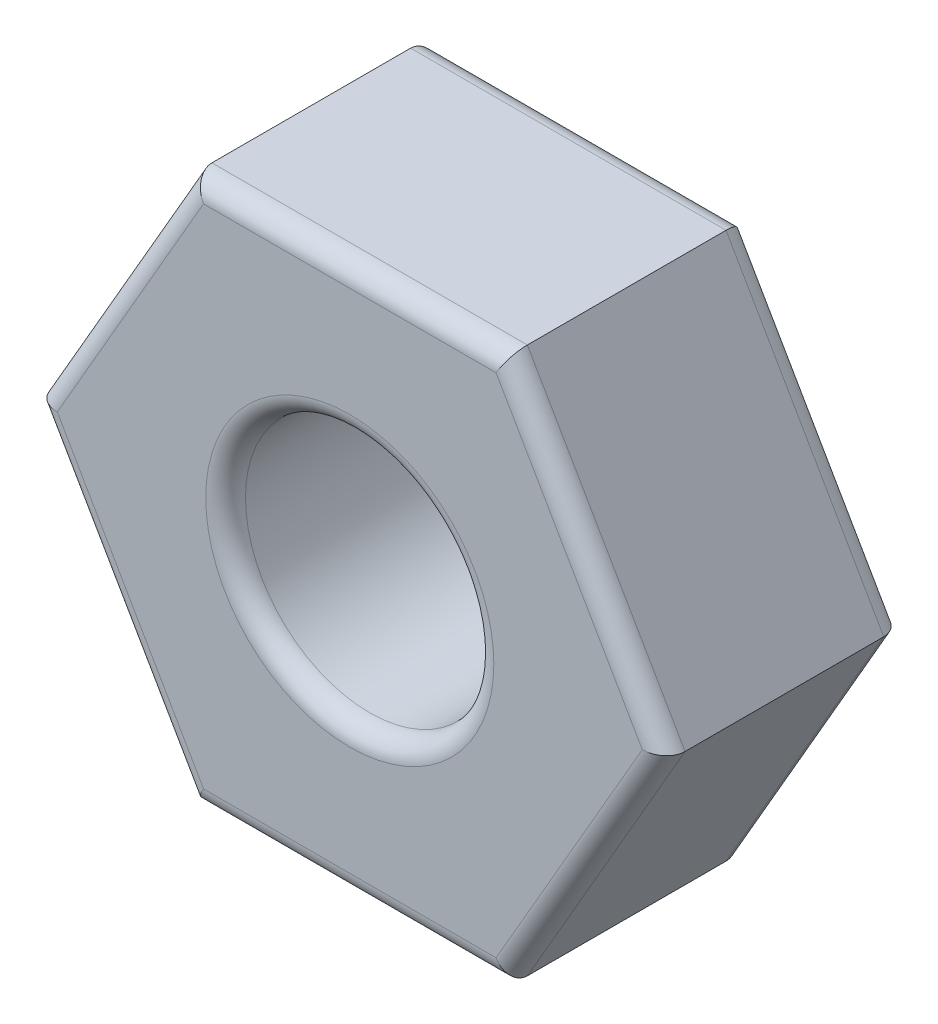
ISO-10303-21;
HEADER;
FILE_DESCRIPTION(('STEP AP214'),'2;1');
FILE_NAME('part.step','',(''),(''),'','','');
FILE_SCHEMA(('AUTOMOTIVE_DESIGN { 1 0 10303 214 1 1 1 1 }'));
ENDSEC;
DATA;
#1=APPLICATION_CONTEXT('core data for automotive mechanical design processes');
#2=APPLICATION_PROTOCOL_DEFINITION('international standard','automotive_design',2000,#1);
#3=PRODUCT_CONTEXT('',#1,'mechanical');
#4=PRODUCT('Part','Part','',(#3));
#5=PRODUCT_RELATED_PRODUCT_CATEGORY('part','',(#4));
#6=PRODUCT_DEFINITION_FORMATION('','',#4);
#7=PRODUCT_DEFINITION_CONTEXT('part definition',#1,'design');
#8=PRODUCT_DEFINITION('design','',#6,#7);
#9=PRODUCT_DEFINITION_SHAPE('','',#8);
#10=(LENGTH_UNIT() NAMED_UNIT(*) SI_UNIT(.MILLI.,.METRE.));
#11=(NAMED_UNIT(*) PLANE_ANGLE_UNIT() SI_UNIT($,.RADIAN.));
#12=(NAMED_UNIT(*) SI_UNIT($,.STERADIAN.) SOLID_ANGLE_UNIT());
#13=UNCERTAINTY_MEASURE_WITH_UNIT(LENGTH_MEASURE(1.E-05),#10,'distance_accuracy_value','');
#14=(GEOMETRIC_REPRESENTATION_CONTEXT(3) GLOBAL_UNCERTAINTY_ASSIGNED_CONTEXT((#13)) GLOBAL_UNIT_ASSIGNED_CONTEXT((#10,
#11,#12)) REPRESENTATION_CONTEXT('',''));
#15=CARTESIAN_POINT('',(0.,0.,0.));
#16=DIRECTION('',(0.,0.,1.));
#17=DIRECTION('',(1.,0.,0.));
#18=AXIS2_PLACEMENT_3D('',#15,#16,#17);
#19=CARTESIAN_POINT('',(0.,0.,2.4));
#20=DIRECTION('',(0.,0.,1.));
#21=DIRECTION('',(1.,0.,0.));
#22=AXIS2_PLACEMENT_3D('',#19,#20,#21);
#23=PLANE('',#22);
#24=CARTESIAN_POINT('',(0.,0.,2.4));
#25=DIRECTION('',(0.,0.,1.));
#26=DIRECTION('',(1.,0.,0.));
#27=AXIS2_PLACEMENT_3D('',#24,#25,#26);
#28=CIRCLE('',#27,1.45);
#29=CARTESIAN_POINT('',(1.45,0.,2.4));
#30=VERTEX_POINT('',#29);
#31=EDGE_CURVE('E11',#30,#30,#28,.F.);
#32=ORIENTED_EDGE('',*,*,#31,.T.);
#33=EDGE_LOOP('',(#32));
#34=FACE_BOUND('',#33,.T.);
#35=DIRECTION('',(0.5,-0.866025403784439,0.));
#36=VECTOR('',#35,1.);
#37=CARTESIAN_POINT('',(-1.41450815951458,-2.65,2.4));
#38=LINE('',#37,#36);
#39=CARTESIAN_POINT('',(-2.94448637286709,0.,2.4));
#40=VERTEX_POINT('',#39);
#41=CARTESIAN_POINT('',(-1.47224318643354,-2.55,2.4));
#42=VERTEX_POINT('',#41);
#43=EDGE_CURVE('E51',#40,#42,#38,.T.);
#44=ORIENTED_EDGE('',*,*,#43,.T.);
#45=DIRECTION('',(1.,0.,0.));
#46=VECTOR('',#45,1.);
#47=CARTESIAN_POINT('',(1.58771324027147,-2.55,2.4));
#48=LINE('',#47,#46);
#49=CARTESIAN_POINT('',(1.47224318643355,-2.55,2.4));
#50=VERTEX_POINT('',#49);
#51=EDGE_CURVE('E43',#42,#50,#48,.T.);
#52=ORIENTED_EDGE('',*,*,#51,.T.);
#53=DIRECTION('',(0.499999999999999,0.866025403784439,0.));
#54=VECTOR('',#53,1.);
#55=CARTESIAN_POINT('',(3.00222139978605,0.100000000000002,2.4));
#56=LINE('',#55,#54);
#57=CARTESIAN_POINT('',(2.94448637286709,0.,2.4));
#58=VERTEX_POINT('',#57);
#59=EDGE_CURVE('E190',#50,#58,#56,.T.);
#60=ORIENTED_EDGE('',*,*,#59,.T.);
#61=DIRECTION('',(-0.5,0.866025403784439,0.));
#62=VECTOR('',#61,1.);
#63=CARTESIAN_POINT('',(1.41450815951458,2.65,2.4));
#64=LINE('',#63,#62);
#65=CARTESIAN_POINT('',(1.47224318643354,2.55,2.4));
#66=VERTEX_POINT('',#65);
#67=EDGE_CURVE('E192',#58,#66,#64,.T.);
#68=ORIENTED_EDGE('',*,*,#67,.T.);
#69=DIRECTION('',(-1.,0.,0.));
#70=VECTOR('',#69,1.);
#71=CARTESIAN_POINT('',(-1.58771324027147,2.55,2.4));
#72=LINE('',#71,#70);
#73=CARTESIAN_POINT('',(-1.47224318643355,2.55,2.4));
#74=VERTEX_POINT('',#73);
#75=EDGE_CURVE('E194',#66,#74,#72,.T.);
#76=ORIENTED_EDGE('',*,*,#75,.T.);
#77=DIRECTION('',(-0.499999999999999,-0.866025403784439,0.));
#78=VECTOR('',#77,1.);
#79=CARTESIAN_POINT('',(-3.00222139978605,-0.100000000000002,2.4));
#80=LINE('',#79,#78);
#81=EDGE_CURVE('E56',#74,#40,#80,.T.);
#82=ORIENTED_EDGE('',*,*,#81,.T.);
#83=EDGE_LOOP('',(#44,#52,#60,#68,#76,#82));
#84=FACE_BOUND('',#83,.T.);
#85=ADVANCED_FACE('F34',(#34,#84),#23,.T.);
#86=CARTESIAN_POINT('',(0.,0.,0.));
#87=DIRECTION('',(0.,0.,1.));
#88=DIRECTION('',(1.,0.,0.));
#89=AXIS2_PLACEMENT_3D('',#86,#87,#88);
#90=PLANE('',#89);
#91=CARTESIAN_POINT('',(0.,0.,0.));
#92=DIRECTION('',(0.,0.,1.));
#93=DIRECTION('',(1.,0.,0.));
#94=AXIS2_PLACEMENT_3D('',#91,#92,#93);
#95=CIRCLE('',#94,1.45);
#96=CARTESIAN_POINT('',(1.45,0.,0.));
#97=VERTEX_POINT('',#96);
#98=EDGE_CURVE('E152',#97,#97,#95,.T.);
#99=ORIENTED_EDGE('',*,*,#98,.T.);
#100=EDGE_LOOP('',(#99));
#101=FACE_BOUND('',#100,.T.);
#102=DIRECTION('',(-1.,0.,0.));
#103=VECTOR('',#102,1.);
#104=CARTESIAN_POINT('',(0.,2.55,0.));
#105=LINE('',#104,#103);
#106=CARTESIAN_POINT('',(-1.47224318643355,2.55,0.));
#107=VERTEX_POINT('',#106);
#108=CARTESIAN_POINT('',(1.47224318643354,2.55,0.));
#109=VERTEX_POINT('',#108);
#110=EDGE_CURVE('E151',#107,#109,#105,.F.);
#111=ORIENTED_EDGE('',*,*,#110,.T.);
#112=DIRECTION('',(-0.5,0.866025403784439,0.));
#113=VECTOR('',#112,1.);
#114=CARTESIAN_POINT('',(2.20836477965032,1.275,0.));
#115=LINE('',#114,#113);
#116=CARTESIAN_POINT('',(2.94448637286709,0.,0.));
#117=VERTEX_POINT('',#116);
#118=EDGE_CURVE('E130',#109,#117,#115,.F.);
#119=ORIENTED_EDGE('',*,*,#118,.T.);
#120=DIRECTION('',(0.499999999999999,0.866025403784439,0.));
#121=VECTOR('',#120,1.);
#122=CARTESIAN_POINT('',(2.20836477965032,-1.275,0.));
#123=LINE('',#122,#121);
#124=CARTESIAN_POINT('',(1.47224318643355,-2.55,0.));
#125=VERTEX_POINT('',#124);
#126=EDGE_CURVE('E140',#117,#125,#123,.F.);
#127=ORIENTED_EDGE('',*,*,#126,.T.);
#128=DIRECTION('',(1.,0.,0.));
#129=VECTOR('',#128,1.);
#130=CARTESIAN_POINT('',(0.,-2.55,0.));
#131=LINE('',#130,#129);
#132=CARTESIAN_POINT('',(-1.47224318643354,-2.55,0.));
#133=VERTEX_POINT('',#132);
#134=EDGE_CURVE('E146',#125,#133,#131,.F.);
#135=ORIENTED_EDGE('',*,*,#134,.T.);
#136=DIRECTION('',(0.5,-0.866025403784439,0.));
#137=VECTOR('',#136,1.);
#138=CARTESIAN_POINT('',(-2.20836477965032,-1.275,0.));
#139=LINE('',#138,#137);
#140=CARTESIAN_POINT('',(-2.94448637286709,0.,0.));
#141=VERTEX_POINT('',#140);
#142=EDGE_CURVE('E252',#133,#141,#139,.F.);
#143=ORIENTED_EDGE('',*,*,#142,.T.);
#144=DIRECTION('',(-0.499999999999999,-0.866025403784439,0.));
#145=VECTOR('',#144,1.);
#146=CARTESIAN_POINT('',(-2.20836477965032,1.275,0.));
#147=LINE('',#146,#145);
#148=EDGE_CURVE('E157',#141,#107,#147,.F.);
#149=ORIENTED_EDGE('',*,*,#148,.T.);
#150=EDGE_LOOP('',(#111,#119,#127,#135,#143,#149));
#151=FACE_BOUND('',#150,.T.);
#152=ADVANCED_FACE('F149',(#101,#151),#90,.F.);
#153=CARTESIAN_POINT('',(1.58771324027147,-2.75,2.4));
#154=DIRECTION('',(-0.866025403784439,0.499999999999999,0.));
#155=DIRECTION('',(-0.499999999999999,-0.866025403784439,0.));
#156=AXIS2_PLACEMENT_3D('',#153,#154,#155);
#157=PLANE('',#156);
#158=DIRECTION('',(0.,0.,-1.));
#159=VECTOR('',#158,1.);
#160=CARTESIAN_POINT('',(1.58771324027147,-2.75,2.4));
#161=LINE('',#160,#159);
#162=CARTESIAN_POINT('',(1.58771324027147,-2.75,2.2));
#163=VERTEX_POINT('',#162);
#164=CARTESIAN_POINT('',(1.58771324027147,-2.75,0.2));
#165=VERTEX_POINT('',#164);
#166=EDGE_CURVE('E209',#163,#165,#161,.T.);
#167=ORIENTED_EDGE('',*,*,#166,.T.);
#168=DIRECTION('',(0.499999999999999,0.866025403784439,0.));
#169=VECTOR('',#168,1.);
#170=CARTESIAN_POINT('',(1.58771324027147,-2.75,0.2));
#171=LINE('',#170,#169);
#172=CARTESIAN_POINT('',(3.17542648054294,0.,0.2));
#173=VERTEX_POINT('',#172);
#174=EDGE_CURVE('E188',#165,#173,#171,.T.);
#175=ORIENTED_EDGE('',*,*,#174,.T.);
#176=DIRECTION('',(0.,0.,-1.));
#177=VECTOR('',#176,1.);
#178=CARTESIAN_POINT('',(3.17542648054294,0.,2.4));
#179=LINE('',#178,#177);
#180=CARTESIAN_POINT('',(3.17542648054294,0.,2.2));
#181=VERTEX_POINT('',#180);
#182=EDGE_CURVE('E147',#181,#173,#179,.T.);
#183=ORIENTED_EDGE('',*,*,#182,.F.);
#184=DIRECTION('',(0.499999999999999,0.866025403784439,0.));
#185=VECTOR('',#184,1.);
#186=CARTESIAN_POINT('',(1.58771324027147,-2.75,2.2));
#187=LINE('',#186,#185);
#188=EDGE_CURVE('E186',#181,#163,#187,.F.);
#189=ORIENTED_EDGE('',*,*,#188,.T.);
#190=EDGE_LOOP('',(#167,#175,#183,#189));
#191=FACE_BOUND('',#190,.T.);
#192=ADVANCED_FACE('F276',(#191),#157,.F.);
#193=CARTESIAN_POINT('',(3.17542648054294,0.,2.4));
#194=DIRECTION('',(-0.866025403784438,-0.5,0.));
#195=DIRECTION('',(0.5,-0.866025403784439,0.));
#196=AXIS2_PLACEMENT_3D('',#193,#194,#195);
#197=PLANE('',#196);
#198=ORIENTED_EDGE('',*,*,#182,.T.);
#199=DIRECTION('',(-0.5,0.866025403784439,0.));
#200=VECTOR('',#199,1.);
#201=CARTESIAN_POINT('',(3.17542648054294,0.,0.2));
#202=LINE('',#201,#200);
#203=CARTESIAN_POINT('',(1.58771324027147,2.75,0.2));
#204=VERTEX_POINT('',#203);
#205=EDGE_CURVE('E133',#173,#204,#202,.T.);
#206=ORIENTED_EDGE('',*,*,#205,.T.);
#207=DIRECTION('',(0.,0.,-1.));
#208=VECTOR('',#207,1.);
#209=CARTESIAN_POINT('',(1.58771324027147,2.75,2.4));
#210=LINE('',#209,#208);
#211=CARTESIAN_POINT('',(1.58771324027147,2.75,2.2));
#212=VERTEX_POINT('',#211);
#213=EDGE_CURVE('E238',#212,#204,#210,.T.);
#214=ORIENTED_EDGE('',*,*,#213,.F.);
#215=DIRECTION('',(-0.5,0.866025403784439,0.));
#216=VECTOR('',#215,1.);
#217=CARTESIAN_POINT('',(3.17542648054294,0.,2.2));
#218=LINE('',#217,#216);
#219=EDGE_CURVE('E166',#212,#181,#218,.F.);
#220=ORIENTED_EDGE('',*,*,#219,.T.);
#221=EDGE_LOOP('',(#198,#206,#214,#220));
#222=FACE_BOUND('',#221,.T.);
#223=ADVANCED_FACE('F243',(#222),#197,.F.);
#224=CARTESIAN_POINT('',(1.58771324027147,2.75,2.4));
#225=DIRECTION('',(0.,-1.,0.));
#226=DIRECTION('',(1.,0.,0.));
#227=AXIS2_PLACEMENT_3D('',#224,#225,#226);
#228=PLANE('',#227);
#229=ORIENTED_EDGE('',*,*,#213,.T.);
#230=DIRECTION('',(-1.,0.,0.));
#231=VECTOR('',#230,1.);
#232=CARTESIAN_POINT('',(1.58771324027147,2.75,0.2));
#233=LINE('',#232,#231);
#234=CARTESIAN_POINT('',(-1.58771324027147,2.75,0.2));
#235=VERTEX_POINT('',#234);
#236=EDGE_CURVE('E171',#204,#235,#233,.T.);
#237=ORIENTED_EDGE('',*,*,#236,.T.);
#238=DIRECTION('',(0.,0.,-1.));
#239=VECTOR('',#238,1.);
#240=CARTESIAN_POINT('',(-1.58771324027147,2.75,2.4));
#241=LINE('',#240,#239);
#242=CARTESIAN_POINT('',(-1.58771324027147,2.75,2.2));
#243=VERTEX_POINT('',#242);
#244=EDGE_CURVE('E240',#243,#235,#241,.T.);
#245=ORIENTED_EDGE('',*,*,#244,.F.);
#246=DIRECTION('',(-1.,0.,0.));
#247=VECTOR('',#246,1.);
#248=CARTESIAN_POINT('',(1.58771324027147,2.75,2.2));
#249=LINE('',#248,#247);
#250=EDGE_CURVE('E169',#243,#212,#249,.F.);
#251=ORIENTED_EDGE('',*,*,#250,.T.);
#252=EDGE_LOOP('',(#229,#237,#245,#251));
#253=FACE_BOUND('',#252,.T.);
#254=ADVANCED_FACE('F237',(#253),#228,.F.);
#255=CARTESIAN_POINT('',(-1.58771324027147,2.75,2.4));
#256=DIRECTION('',(0.866025403784439,-0.499999999999999,0.));
#257=DIRECTION('',(0.499999999999999,0.866025403784439,0.));
#258=AXIS2_PLACEMENT_3D('',#255,#256,#257);
#259=PLANE('',#258);
#260=ORIENTED_EDGE('',*,*,#244,.T.);
#261=DIRECTION('',(-0.499999999999999,-0.866025403784439,0.));
#262=VECTOR('',#261,1.);
#263=CARTESIAN_POINT('',(-1.58771324027147,2.75,0.2));
#264=LINE('',#263,#262);
#265=CARTESIAN_POINT('',(-3.17542648054294,0.,0.2));
#266=VERTEX_POINT('',#265);
#267=EDGE_CURVE('E175',#235,#266,#264,.T.);
#268=ORIENTED_EDGE('',*,*,#267,.T.);
#269=DIRECTION('',(0.,0.,-1.));
#270=VECTOR('',#269,1.);
#271=CARTESIAN_POINT('',(-3.17542648054294,0.,2.4));
#272=LINE('',#271,#270);
#273=CARTESIAN_POINT('',(-3.17542648054294,0.,2.2));
#274=VERTEX_POINT('',#273);
#275=EDGE_CURVE('E247',#274,#266,#272,.T.);
#276=ORIENTED_EDGE('',*,*,#275,.F.);
#277=DIRECTION('',(-0.499999999999999,-0.866025403784439,0.));
#278=VECTOR('',#277,1.);
#279=CARTESIAN_POINT('',(-1.58771324027147,2.75,2.2));
#280=LINE('',#279,#278);
#281=EDGE_CURVE('E173',#274,#243,#280,.F.);
#282=ORIENTED_EDGE('',*,*,#281,.T.);
#283=EDGE_LOOP('',(#260,#268,#276,#282));
#284=FACE_BOUND('',#283,.T.);
#285=ADVANCED_FACE('F264',(#284),#259,.F.);
#286=CARTESIAN_POINT('',(-3.17542648054294,0.,2.4));
#287=DIRECTION('',(0.866025403784438,0.5,0.));
#288=DIRECTION('',(-0.5,0.866025403784439,0.));
#289=AXIS2_PLACEMENT_3D('',#286,#287,#288);
#290=PLANE('',#289);
#291=ORIENTED_EDGE('',*,*,#275,.T.);
#292=DIRECTION('',(0.5,-0.866025403784439,0.));
#293=VECTOR('',#292,1.);
#294=CARTESIAN_POINT('',(-3.17542648054294,0.,0.2));
#295=LINE('',#294,#293);
#296=CARTESIAN_POINT('',(-1.58771324027147,-2.75,0.2));
#297=VERTEX_POINT('',#296);
#298=EDGE_CURVE('E179',#266,#297,#295,.T.);
#299=ORIENTED_EDGE('',*,*,#298,.T.);
#300=DIRECTION('',(0.,0.,-1.));
#301=VECTOR('',#300,1.);
#302=CARTESIAN_POINT('',(-1.58771324027147,-2.75,2.4));
#303=LINE('',#302,#301);
#304=CARTESIAN_POINT('',(-1.58771324027147,-2.75,2.2));
#305=VERTEX_POINT('',#304);
#306=EDGE_CURVE('E269',#305,#297,#303,.T.);
#307=ORIENTED_EDGE('',*,*,#306,.F.);
#308=DIRECTION('',(0.5,-0.866025403784439,0.));
#309=VECTOR('',#308,1.);
#310=CARTESIAN_POINT('',(-3.17542648054294,0.,2.2));
#311=LINE('',#310,#309);
#312=EDGE_CURVE('E177',#305,#274,#311,.F.);
#313=ORIENTED_EDGE('',*,*,#312,.T.);
#314=EDGE_LOOP('',(#291,#299,#307,#313));
#315=FACE_BOUND('',#314,.T.);
#316=ADVANCED_FACE('F287',(#315),#290,.F.);
#317=CARTESIAN_POINT('',(-1.58771324027147,-2.75,2.4));
#318=DIRECTION('',(0.,1.,0.));
#319=DIRECTION('',(-1.,0.,0.));
#320=AXIS2_PLACEMENT_3D('',#317,#318,#319);
#321=PLANE('',#320);
#322=ORIENTED_EDGE('',*,*,#306,.T.);
#323=DIRECTION('',(1.,0.,0.));
#324=VECTOR('',#323,1.);
#325=CARTESIAN_POINT('',(-1.58771324027147,-2.75,0.2));
#326=LINE('',#325,#324);
#327=EDGE_CURVE('E184',#297,#165,#326,.T.);
#328=ORIENTED_EDGE('',*,*,#327,.T.);
#329=ORIENTED_EDGE('',*,*,#166,.F.);
#330=DIRECTION('',(1.,0.,0.));
#331=VECTOR('',#330,1.);
#332=CARTESIAN_POINT('',(-1.58771324027147,-2.75,2.2));
#333=LINE('',#332,#331);
#334=EDGE_CURVE('E181',#163,#305,#333,.F.);
#335=ORIENTED_EDGE('',*,*,#334,.T.);
#336=EDGE_LOOP('',(#322,#328,#329,#335));
#337=FACE_BOUND('',#336,.T.);
#338=ADVANCED_FACE('F288',(#337),#321,.F.);
#339=CARTESIAN_POINT('',(0.,0.,2.4));
#340=DIRECTION('',(0.,0.,-1.));
#341=DIRECTION('',(-1.,0.,0.));
#342=AXIS2_PLACEMENT_3D('',#339,#340,#341);
#343=CYLINDRICAL_SURFACE('',#342,1.25);
#344=CARTESIAN_POINT('',(0.,0.,0.2));
#345=DIRECTION('',(0.,0.,1.));
#346=DIRECTION('',(1.,0.,0.));
#347=AXIS2_PLACEMENT_3D('',#344,#345,#346);
#348=CIRCLE('',#347,1.25);
#349=CARTESIAN_POINT('',(1.25,0.,0.2));
#350=VERTEX_POINT('',#349);
#351=EDGE_CURVE('E163',#350,#350,#348,.F.);
#352=ORIENTED_EDGE('',*,*,#351,.T.);
#353=EDGE_LOOP('',(#352));
#354=FACE_BOUND('',#353,.T.);
#355=CARTESIAN_POINT('',(0.,0.,2.2));
#356=DIRECTION('',(0.,0.,1.));
#357=DIRECTION('',(1.,0.,0.));
#358=AXIS2_PLACEMENT_3D('',#355,#356,#357);
#359=CIRCLE('',#358,1.25);
#360=CARTESIAN_POINT('',(1.25,0.,2.2));
#361=VERTEX_POINT('',#360);
#362=EDGE_CURVE('E155',#361,#361,#359,.T.);
#363=ORIENTED_EDGE('',*,*,#362,.T.);
#364=EDGE_LOOP('',(#363));
#365=FACE_BOUND('',#364,.T.);
#366=ADVANCED_FACE('F307',(#354,#365),#343,.F.);
#367=CARTESIAN_POINT('',(0.,0.,0.2));
#368=DIRECTION('',(0.,0.,1.));
#369=DIRECTION('',(1.,0.,0.));
#370=AXIS2_PLACEMENT_3D('',#367,#368,#369);
#371=TOROIDAL_SURFACE('',#370,1.45,0.2);
#372=ORIENTED_EDGE('',*,*,#351,.F.);
#373=EDGE_LOOP('',(#372));
#374=FACE_BOUND('',#373,.T.);
#375=ORIENTED_EDGE('',*,*,#98,.F.);
#376=EDGE_LOOP('',(#375));
#377=FACE_BOUND('',#376,.T.);
#378=ADVANCED_FACE('F321',(#374,#377),#371,.T.);
#379=CARTESIAN_POINT('',(-3.00222139978605,0.0999999999999979,0.2));
#380=DIRECTION('',(0.5,-0.866025403784439,0.));
#381=DIRECTION('',(0.866025403784438,0.5,0.));
#382=AXIS2_PLACEMENT_3D('',#379,#380,#381);
#383=CYLINDRICAL_SURFACE('',#382,0.2);
#384=CARTESIAN_POINT('',(-2.94448637286709,0.,0.2));
#385=DIRECTION('',(0.,-1.,0.));
#386=DIRECTION('',(1.,0.,0.));
#387=AXIS2_PLACEMENT_3D('',#384,#385,#386);
#388=ELLIPSE('',#387,0.23094010767585,0.2);
#389=EDGE_CURVE('E203',#141,#266,#388,.F.);
#390=ORIENTED_EDGE('',*,*,#389,.F.);
#391=ORIENTED_EDGE('',*,*,#142,.F.);
#392=CARTESIAN_POINT('',(-1.47224318643354,-2.55,0.2));
#393=DIRECTION('',(0.866025403784439,-0.5,0.));
#394=DIRECTION('',(0.5,0.866025403784439,0.));
#395=AXIS2_PLACEMENT_3D('',#392,#393,#394);
#396=ELLIPSE('',#395,0.23094010767585,0.2);
#397=EDGE_CURVE('E206',#297,#133,#396,.T.);
#398=ORIENTED_EDGE('',*,*,#397,.F.);
#399=ORIENTED_EDGE('',*,*,#298,.F.);
#400=EDGE_LOOP('',(#390,#391,#398,#399));
#401=FACE_BOUND('',#400,.T.);
#402=ADVANCED_FACE('F285',(#401),#383,.T.);
#403=CARTESIAN_POINT('',(-1.58771324027147,-2.55,0.2));
#404=DIRECTION('',(1.,0.,0.));
#405=DIRECTION('',(0.,1.,0.));
#406=AXIS2_PLACEMENT_3D('',#403,#404,#405);
#407=CYLINDRICAL_SURFACE('',#406,0.2);
#408=ORIENTED_EDGE('',*,*,#397,.T.);
#409=ORIENTED_EDGE('',*,*,#134,.F.);
#410=CARTESIAN_POINT('',(1.47224318643355,-2.55,0.2));
#411=DIRECTION('',(0.866025403784438,0.5,0.));
#412=DIRECTION('',(-0.5,0.866025403784439,0.));
#413=AXIS2_PLACEMENT_3D('',#410,#411,#412);
#414=ELLIPSE('',#413,0.23094010767585,0.2);
#415=EDGE_CURVE('E143',#165,#125,#414,.T.);
#416=ORIENTED_EDGE('',*,*,#415,.F.);
#417=ORIENTED_EDGE('',*,*,#327,.F.);
#418=EDGE_LOOP('',(#408,#409,#416,#417));
#419=FACE_BOUND('',#418,.T.);
#420=ADVANCED_FACE('F282',(#419),#407,.T.);
#421=CARTESIAN_POINT('',(-1.41450815951458,2.65,0.2));
#422=DIRECTION('',(-0.499999999999999,-0.866025403784439,0.));
#423=DIRECTION('',(0.866025403784439,-0.499999999999999,0.));
#424=AXIS2_PLACEMENT_3D('',#421,#422,#423);
#425=CYLINDRICAL_SURFACE('',#424,0.2);
#426=ORIENTED_EDGE('',*,*,#389,.T.);
#427=ORIENTED_EDGE('',*,*,#267,.F.);
#428=CARTESIAN_POINT('',(-1.47224318643355,2.55,0.2));
#429=DIRECTION('',(-0.866025403784438,-0.5,0.));
#430=DIRECTION('',(0.5,-0.866025403784438,0.));
#431=AXIS2_PLACEMENT_3D('',#428,#429,#430);
#432=ELLIPSE('',#431,0.23094010767585,0.2);
#433=EDGE_CURVE('E136',#107,#235,#432,.F.);
#434=ORIENTED_EDGE('',*,*,#433,.F.);
#435=ORIENTED_EDGE('',*,*,#148,.F.);
#436=EDGE_LOOP('',(#426,#427,#434,#435));
#437=FACE_BOUND('',#436,.T.);
#438=ADVANCED_FACE('F259',(#437),#425,.T.);
#439=CARTESIAN_POINT('',(1.41450815951458,-2.65,0.2));
#440=DIRECTION('',(0.499999999999999,0.866025403784439,0.));
#441=DIRECTION('',(-0.866025403784439,0.499999999999999,0.));
#442=AXIS2_PLACEMENT_3D('',#439,#440,#441);
#443=CYLINDRICAL_SURFACE('',#442,0.2);
#444=ORIENTED_EDGE('',*,*,#415,.T.);
#445=ORIENTED_EDGE('',*,*,#126,.F.);
#446=CARTESIAN_POINT('',(2.94448637286709,0.,0.2));
#447=DIRECTION('',(0.,1.,0.));
#448=DIRECTION('',(1.,0.,0.));
#449=AXIS2_PLACEMENT_3D('',#446,#447,#448);
#450=ELLIPSE('',#449,0.23094010767585,0.2);
#451=EDGE_CURVE('E126',#173,#117,#450,.T.);
#452=ORIENTED_EDGE('',*,*,#451,.F.);
#453=ORIENTED_EDGE('',*,*,#174,.F.);
#454=EDGE_LOOP('',(#444,#445,#452,#453));
#455=FACE_BOUND('',#454,.T.);
#456=ADVANCED_FACE('F141',(#455),#443,.T.);
#457=CARTESIAN_POINT('',(1.58771324027147,2.55,0.2));
#458=DIRECTION('',(-1.,0.,0.));
#459=DIRECTION('',(0.,-1.,0.));
#460=AXIS2_PLACEMENT_3D('',#457,#458,#459);
#461=CYLINDRICAL_SURFACE('',#460,0.2);
#462=ORIENTED_EDGE('',*,*,#433,.T.);
#463=ORIENTED_EDGE('',*,*,#236,.F.);
#464=CARTESIAN_POINT('',(1.47224318643354,2.55,0.2));
#465=DIRECTION('',(-0.866025403784439,0.5,0.));
#466=DIRECTION('',(-0.5,-0.866025403784439,0.));
#467=AXIS2_PLACEMENT_3D('',#464,#465,#466);
#468=ELLIPSE('',#467,0.23094010767585,0.2);
#469=EDGE_CURVE('E137',#109,#204,#468,.F.);
#470=ORIENTED_EDGE('',*,*,#469,.F.);
#471=ORIENTED_EDGE('',*,*,#110,.F.);
#472=EDGE_LOOP('',(#462,#463,#470,#471));
#473=FACE_BOUND('',#472,.T.);
#474=ADVANCED_FACE('F262',(#473),#461,.T.);
#475=CARTESIAN_POINT('',(3.00222139978605,-0.0999999999999979,0.2));
#476=DIRECTION('',(-0.5,0.866025403784439,0.));
#477=DIRECTION('',(-0.866025403784438,-0.5,0.));
#478=AXIS2_PLACEMENT_3D('',#475,#476,#477);
#479=CYLINDRICAL_SURFACE('',#478,0.2);
#480=ORIENTED_EDGE('',*,*,#451,.T.);
#481=ORIENTED_EDGE('',*,*,#118,.F.);
#482=ORIENTED_EDGE('',*,*,#469,.T.);
#483=ORIENTED_EDGE('',*,*,#205,.F.);
#484=EDGE_LOOP('',(#480,#481,#482,#483));
#485=FACE_BOUND('',#484,.T.);
#486=ADVANCED_FACE('F128',(#485),#479,.T.);
#487=CARTESIAN_POINT('',(0.,0.,2.2));
#488=DIRECTION('',(0.,0.,1.));
#489=DIRECTION('',(1.,0.,0.));
#490=AXIS2_PLACEMENT_3D('',#487,#488,#489);
#491=TOROIDAL_SURFACE('',#490,1.45,0.2);
#492=ORIENTED_EDGE('',*,*,#31,.F.);
#493=EDGE_LOOP('',(#492));
#494=FACE_BOUND('',#493,.T.);
#495=ORIENTED_EDGE('',*,*,#362,.F.);
#496=EDGE_LOOP('',(#495));
#497=FACE_BOUND('',#496,.T.);
#498=ADVANCED_FACE('F327',(#494,#497),#491,.T.);
#499=CARTESIAN_POINT('',(0.,2.55,2.2));
#500=DIRECTION('',(1.,0.,0.));
#501=DIRECTION('',(0.,1.,0.));
#502=AXIS2_PLACEMENT_3D('',#499,#500,#501);
#503=CYLINDRICAL_SURFACE('',#502,0.2);
#504=CARTESIAN_POINT('',(1.47224318643354,2.55,2.2));
#505=DIRECTION('',(0.866025403784439,-0.5,0.));
#506=DIRECTION('',(-0.5,-0.866025403784439,0.));
#507=AXIS2_PLACEMENT_3D('',#504,#505,#506);
#508=ELLIPSE('',#507,0.23094010767585,0.2);
#509=EDGE_CURVE('E219',#212,#66,#508,.T.);
#510=ORIENTED_EDGE('',*,*,#509,.F.);
#511=ORIENTED_EDGE('',*,*,#250,.F.);
#512=CARTESIAN_POINT('',(-1.47224318643355,2.55,2.2));
#513=DIRECTION('',(0.866025403784438,0.5,0.));
#514=DIRECTION('',(0.5,-0.866025403784438,0.));
#515=AXIS2_PLACEMENT_3D('',#512,#513,#514);
#516=ELLIPSE('',#515,0.23094010767585,0.2);
#517=EDGE_CURVE('E38',#74,#243,#516,.F.);
#518=ORIENTED_EDGE('',*,*,#517,.F.);
#519=ORIENTED_EDGE('',*,*,#75,.F.);
#520=EDGE_LOOP('',(#510,#511,#518,#519));
#521=FACE_BOUND('',#520,.T.);
#522=ADVANCED_FACE('F36',(#521),#503,.T.);
#523=CARTESIAN_POINT('',(-2.20836477965032,1.275,2.2));
#524=DIRECTION('',(0.499999999999999,0.866025403784439,0.));
#525=DIRECTION('',(-0.866025403784439,0.499999999999999,0.));
#526=AXIS2_PLACEMENT_3D('',#523,#524,#525);
#527=CYLINDRICAL_SURFACE('',#526,0.2);
#528=ORIENTED_EDGE('',*,*,#517,.T.);
#529=ORIENTED_EDGE('',*,*,#281,.F.);
#530=CARTESIAN_POINT('',(-2.94448637286709,0.,2.2));
#531=DIRECTION('',(0.,1.,0.));
#532=DIRECTION('',(1.,0.,0.));
#533=AXIS2_PLACEMENT_3D('',#530,#531,#532);
#534=ELLIPSE('',#533,0.23094010767585,0.2);
#535=EDGE_CURVE('E217',#40,#274,#534,.F.);
#536=ORIENTED_EDGE('',*,*,#535,.F.);
#537=ORIENTED_EDGE('',*,*,#81,.F.);
#538=EDGE_LOOP('',(#528,#529,#536,#537));
#539=FACE_BOUND('',#538,.T.);
#540=ADVANCED_FACE('F229',(#539),#527,.T.);
#541=CARTESIAN_POINT('',(2.20836477965032,1.275,2.2));
#542=DIRECTION('',(0.5,-0.866025403784439,0.));
#543=DIRECTION('',(0.866025403784438,0.5,0.));
#544=AXIS2_PLACEMENT_3D('',#541,#542,#543);
#545=CYLINDRICAL_SURFACE('',#544,0.2);
#546=ORIENTED_EDGE('',*,*,#509,.T.);
#547=ORIENTED_EDGE('',*,*,#67,.F.);
#548=CARTESIAN_POINT('',(2.94448637286709,0.,2.2));
#549=DIRECTION('',(0.,-1.,0.));
#550=DIRECTION('',(-1.,0.,0.));
#551=AXIS2_PLACEMENT_3D('',#548,#549,#550);
#552=ELLIPSE('',#551,0.23094010767585,0.2);
#553=EDGE_CURVE('E214',#181,#58,#552,.T.);
#554=ORIENTED_EDGE('',*,*,#553,.F.);
#555=ORIENTED_EDGE('',*,*,#219,.F.);
#556=EDGE_LOOP('',(#546,#547,#554,#555));
#557=FACE_BOUND('',#556,.T.);
#558=ADVANCED_FACE('F348',(#557),#545,.T.);
#559=CARTESIAN_POINT('',(-2.20836477965032,-1.275,2.2));
#560=DIRECTION('',(-0.5,0.866025403784439,0.));
#561=DIRECTION('',(-0.866025403784438,-0.5,0.));
#562=AXIS2_PLACEMENT_3D('',#559,#560,#561);
#563=CYLINDRICAL_SURFACE('',#562,0.2);
#564=ORIENTED_EDGE('',*,*,#535,.T.);
#565=ORIENTED_EDGE('',*,*,#312,.F.);
#566=CARTESIAN_POINT('',(-1.47224318643354,-2.55,2.2));
#567=DIRECTION('',(-0.866025403784439,0.5,0.));
#568=DIRECTION('',(0.5,0.866025403784439,0.));
#569=AXIS2_PLACEMENT_3D('',#566,#567,#568);
#570=ELLIPSE('',#569,0.23094010767585,0.2);
#571=EDGE_CURVE('E212',#42,#305,#570,.F.);
#572=ORIENTED_EDGE('',*,*,#571,.F.);
#573=ORIENTED_EDGE('',*,*,#43,.F.);
#574=EDGE_LOOP('',(#564,#565,#572,#573));
#575=FACE_BOUND('',#574,.T.);
#576=ADVANCED_FACE('F345',(#575),#563,.T.);
#577=CARTESIAN_POINT('',(2.20836477965032,-1.275,2.2));
#578=DIRECTION('',(-0.499999999999999,-0.866025403784439,0.));
#579=DIRECTION('',(0.866025403784439,-0.499999999999999,0.));
#580=AXIS2_PLACEMENT_3D('',#577,#578,#579);
#581=CYLINDRICAL_SURFACE('',#580,0.2);
#582=ORIENTED_EDGE('',*,*,#553,.T.);
#583=ORIENTED_EDGE('',*,*,#59,.F.);
#584=CARTESIAN_POINT('',(1.47224318643355,-2.55,2.2));
#585=DIRECTION('',(-0.866025403784438,-0.5,0.));
#586=DIRECTION('',(0.5,-0.866025403784439,0.));
#587=AXIS2_PLACEMENT_3D('',#584,#585,#586);
#588=ELLIPSE('',#587,0.23094010767585,0.2);
#589=EDGE_CURVE('E210',#163,#50,#588,.T.);
#590=ORIENTED_EDGE('',*,*,#589,.F.);
#591=ORIENTED_EDGE('',*,*,#188,.F.);
#592=EDGE_LOOP('',(#582,#583,#590,#591));
#593=FACE_BOUND('',#592,.T.);
#594=ADVANCED_FACE('F296',(#593),#581,.T.);
#595=CARTESIAN_POINT('',(0.,-2.55,2.2));
#596=DIRECTION('',(-1.,0.,0.));
#597=DIRECTION('',(0.,-1.,0.));
#598=AXIS2_PLACEMENT_3D('',#595,#596,#597);
#599=CYLINDRICAL_SURFACE('',#598,0.2);
#600=ORIENTED_EDGE('',*,*,#571,.T.);
#601=ORIENTED_EDGE('',*,*,#334,.F.);
#602=ORIENTED_EDGE('',*,*,#589,.T.);
#603=ORIENTED_EDGE('',*,*,#51,.F.);
#604=EDGE_LOOP('',(#600,#601,#602,#603));
#605=FACE_BOUND('',#604,.T.);
#606=ADVANCED_FACE('F291',(#605),#599,.T.);
#607=CLOSED_SHELL('',(#85,#152,#192,#223,#254,#285,#316,#338,#366,#378,#402,#420,#438,#456,#474,
#486,#498,#522,#540,#558,#576,#594,#606));
#608=MANIFOLD_SOLID_BREP('B2',#607);
#609=ADVANCED_BREP_SHAPE_REPRESENTATION('',(#18,#608),#14);
#610=SHAPE_DEFINITION_REPRESENTATION(#9,#609);
ENDSEC;
END-ISO-10303-21;
